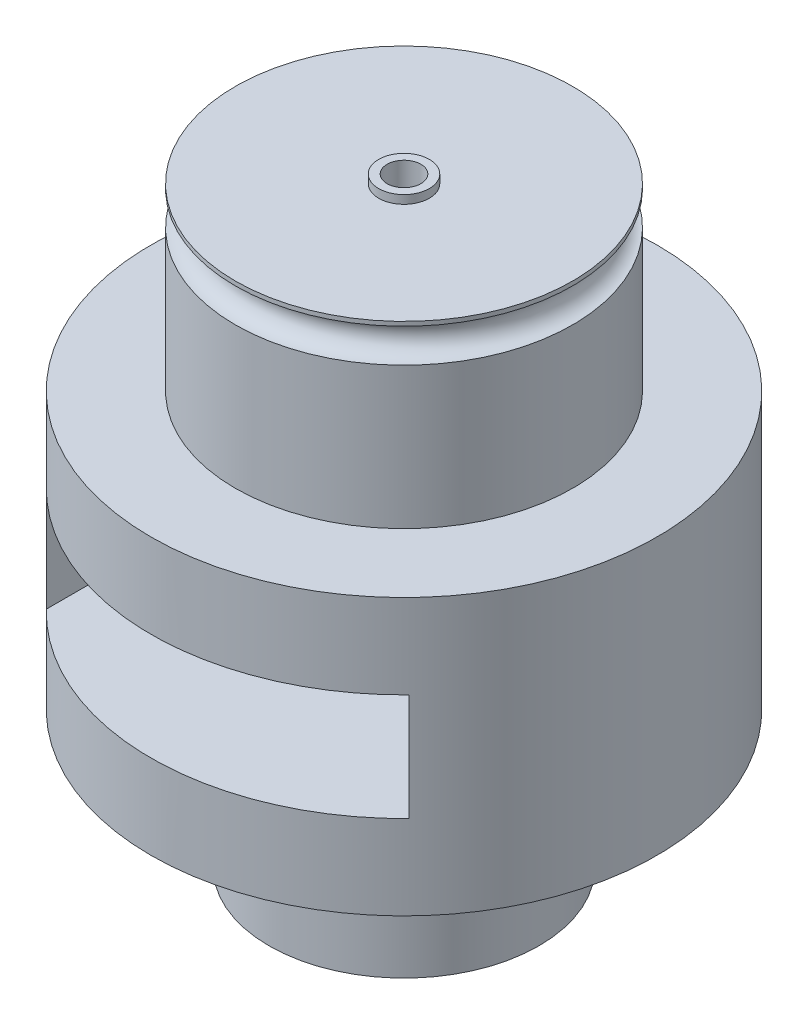
ISO-10303-21;
HEADER;
FILE_DESCRIPTION(('STEP AP214'),'2;1');
FILE_NAME('part.step','',(''),(''),'','','');
FILE_SCHEMA(('AUTOMOTIVE_DESIGN { 1 0 10303 214 1 1 1 1 }'));
ENDSEC;
DATA;
#1=APPLICATION_CONTEXT('core data for automotive mechanical design processes');
#2=APPLICATION_PROTOCOL_DEFINITION('international standard','automotive_design',2000,#1);
#3=PRODUCT_CONTEXT('',#1,'mechanical');
#4=PRODUCT('Part','Part','',(#3));
#5=PRODUCT_RELATED_PRODUCT_CATEGORY('part','',(#4));
#6=PRODUCT_DEFINITION_FORMATION('','',#4);
#7=PRODUCT_DEFINITION_CONTEXT('part definition',#1,'design');
#8=PRODUCT_DEFINITION('design','',#6,#7);
#9=PRODUCT_DEFINITION_SHAPE('','',#8);
#10=(LENGTH_UNIT() NAMED_UNIT(*) SI_UNIT(.MILLI.,.METRE.));
#11=(NAMED_UNIT(*) PLANE_ANGLE_UNIT() SI_UNIT($,.RADIAN.));
#12=(NAMED_UNIT(*) SI_UNIT($,.STERADIAN.) SOLID_ANGLE_UNIT());
#13=UNCERTAINTY_MEASURE_WITH_UNIT(LENGTH_MEASURE(1.E-05),#10,'distance_accuracy_value','');
#14=(GEOMETRIC_REPRESENTATION_CONTEXT(3) GLOBAL_UNCERTAINTY_ASSIGNED_CONTEXT((#13)) GLOBAL_UNIT_ASSIGNED_CONTEXT((#10,
#11,#12)) REPRESENTATION_CONTEXT('',''));
#15=CARTESIAN_POINT('',(0.,0.,0.));
#16=DIRECTION('',(0.,0.,1.));
#17=DIRECTION('',(1.,0.,0.));
#18=AXIS2_PLACEMENT_3D('',#15,#16,#17);
#19=CARTESIAN_POINT('',(0.,32.6375,0.));
#20=DIRECTION('',(0.,-1.,0.));
#21=DIRECTION('',(0.,0.,-1.));
#22=AXIS2_PLACEMENT_3D('',#19,#20,#21);
#23=CYLINDRICAL_SURFACE('',#22,15.);
#24=CARTESIAN_POINT('',(0.,8.14375,0.));
#25=DIRECTION('',(0.,-1.,0.));
#26=DIRECTION('',(0.,0.,-1.));
#27=AXIS2_PLACEMENT_3D('',#24,#25,#26);
#28=CIRCLE('',#27,15.);
#29=CARTESIAN_POINT('',(0.,8.14375,-15.));
#30=VERTEX_POINT('',#29);
#31=EDGE_CURVE('E176',#30,#30,#28,.F.);
#32=ORIENTED_EDGE('',*,*,#31,.T.);
#33=EDGE_LOOP('',(#32));
#34=FACE_BOUND('',#33,.T.);
#35=DIRECTION('',(0.,-1.,0.));
#36=VECTOR('',#35,1.);
#37=CARTESIAN_POINT('',(10.75,32.6375,-10.4612379764538));
#38=LINE('',#37,#36);
#39=CARTESIAN_POINT('',(10.75,13.14375,-10.4612379764538));
#40=VERTEX_POINT('',#39);
#41=CARTESIAN_POINT('',(10.75,19.49375,-10.4612379764538));
#42=VERTEX_POINT('',#41);
#43=EDGE_CURVE('E136',#40,#42,#38,.F.);
#44=ORIENTED_EDGE('',*,*,#43,.T.);
#45=CARTESIAN_POINT('',(0.,19.49375,0.));
#46=DIRECTION('',(0.,1.,0.));
#47=DIRECTION('',(0.,0.,1.));
#48=AXIS2_PLACEMENT_3D('',#45,#46,#47);
#49=CIRCLE('',#48,15.);
#50=CARTESIAN_POINT('',(-10.75,19.49375,-10.4612379764538));
#51=VERTEX_POINT('',#50);
#52=EDGE_CURVE('E111',#42,#51,#49,.T.);
#53=ORIENTED_EDGE('',*,*,#52,.T.);
#54=DIRECTION('',(0.,-1.,0.));
#55=VECTOR('',#54,1.);
#56=CARTESIAN_POINT('',(-10.75,32.6375,-10.4612379764538));
#57=LINE('',#56,#55);
#58=CARTESIAN_POINT('',(-10.75,13.14375,-10.4612379764538));
#59=VERTEX_POINT('',#58);
#60=EDGE_CURVE('E121',#51,#59,#57,.T.);
#61=ORIENTED_EDGE('',*,*,#60,.T.);
#62=CARTESIAN_POINT('',(0.,13.14375,0.));
#63=DIRECTION('',(0.,-1.,0.));
#64=DIRECTION('',(0.,0.,-1.));
#65=AXIS2_PLACEMENT_3D('',#62,#63,#64);
#66=CIRCLE('',#65,15.);
#67=EDGE_CURVE('E129',#59,#40,#66,.T.);
#68=ORIENTED_EDGE('',*,*,#67,.T.);
#69=EDGE_LOOP('',(#44,#53,#61,#68));
#70=FACE_BOUND('',#69,.T.);
#71=CARTESIAN_POINT('',(-10.75,19.49375,10.4612379764538));
#72=VERTEX_POINT('',#71);
#73=CARTESIAN_POINT('',(10.75,19.49375,10.4612379764538));
#74=VERTEX_POINT('',#73);
#75=EDGE_CURVE('E100',#72,#74,#49,.T.);
#76=ORIENTED_EDGE('',*,*,#75,.T.);
#77=DIRECTION('',(0.,-1.,0.));
#78=VECTOR('',#77,1.);
#79=CARTESIAN_POINT('',(10.75,32.6375,10.4612379764538));
#80=LINE('',#79,#78);
#81=CARTESIAN_POINT('',(10.75,13.14375,10.4612379764538));
#82=VERTEX_POINT('',#81);
#83=EDGE_CURVE('E126',#74,#82,#80,.T.);
#84=ORIENTED_EDGE('',*,*,#83,.T.);
#85=CARTESIAN_POINT('',(-10.75,13.14375,10.4612379764538));
#86=VERTEX_POINT('',#85);
#87=EDGE_CURVE('E125',#82,#86,#66,.T.);
#88=ORIENTED_EDGE('',*,*,#87,.T.);
#89=DIRECTION('',(0.,-1.,0.));
#90=VECTOR('',#89,1.);
#91=CARTESIAN_POINT('',(-10.75,32.6375,10.4612379764538));
#92=LINE('',#91,#90);
#93=EDGE_CURVE('E118',#86,#72,#92,.F.);
#94=ORIENTED_EDGE('',*,*,#93,.T.);
#95=EDGE_LOOP('',(#76,#84,#88,#94));
#96=FACE_BOUND('',#95,.T.);
#97=CARTESIAN_POINT('',(0.,24.49375,0.));
#98=DIRECTION('',(0.,1.,0.));
#99=DIRECTION('',(0.,0.,1.));
#100=AXIS2_PLACEMENT_3D('',#97,#98,#99);
#101=CIRCLE('',#100,15.);
#102=CARTESIAN_POINT('',(0.,24.49375,15.));
#103=VERTEX_POINT('',#102);
#104=EDGE_CURVE('E227',#103,#103,#101,.F.);
#105=ORIENTED_EDGE('',*,*,#104,.T.);
#106=EDGE_LOOP('',(#105));
#107=FACE_BOUND('',#106,.T.);
#108=ADVANCED_FACE('F57',(#34,#70,#96,#107),#23,.T.);
#109=CARTESIAN_POINT('',(0.,0.,0.));
#110=DIRECTION('',(0.,1.,0.));
#111=DIRECTION('',(0.,0.,1.));
#112=AXIS2_PLACEMENT_3D('',#109,#110,#111);
#113=PLANE('',#112);
#114=CARTESIAN_POINT('',(0.,0.,0.));
#115=DIRECTION('',(0.,1.,0.));
#116=DIRECTION('',(0.,0.,1.));
#117=AXIS2_PLACEMENT_3D('',#114,#115,#116);
#118=CIRCLE('',#117,1.5);
#119=CARTESIAN_POINT('',(0.,0.,1.5));
#120=VERTEX_POINT('',#119);
#121=EDGE_CURVE('E139',#120,#120,#118,.F.);
#122=ORIENTED_EDGE('',*,*,#121,.F.);
#123=EDGE_LOOP('',(#122));
#124=FACE_BOUND('',#123,.T.);
#125=CARTESIAN_POINT('',(0.,0.,0.));
#126=DIRECTION('',(0.,1.,0.));
#127=DIRECTION('',(0.,0.,1.));
#128=AXIS2_PLACEMENT_3D('',#125,#126,#127);
#129=CIRCLE('',#128,8.00000000000001);
#130=CARTESIAN_POINT('',(0.,0.,8.00000000000001));
#131=VERTEX_POINT('',#130);
#132=EDGE_CURVE('E60',#131,#131,#129,.T.);
#133=ORIENTED_EDGE('',*,*,#132,.F.);
#134=EDGE_LOOP('',(#133));
#135=FACE_BOUND('',#134,.T.);
#136=ADVANCED_FACE('F165',(#124,#135),#113,.F.);
#137=CARTESIAN_POINT('',(0.,35.1375,0.));
#138=DIRECTION('',(0.,1.,0.));
#139=DIRECTION('',(0.,0.,1.));
#140=AXIS2_PLACEMENT_3D('',#137,#138,#139);
#141=PLANE('',#140);
#142=CARTESIAN_POINT('',(0.,35.1375,0.));
#143=DIRECTION('',(0.,1.,0.));
#144=DIRECTION('',(0.,0.,1.));
#145=AXIS2_PLACEMENT_3D('',#142,#143,#144);
#146=CIRCLE('',#145,10.);
#147=CARTESIAN_POINT('',(0.,35.1375,10.));
#148=VERTEX_POINT('',#147);
#149=EDGE_CURVE('E205',#148,#148,#146,.T.);
#150=ORIENTED_EDGE('',*,*,#149,.T.);
#151=EDGE_LOOP('',(#150));
#152=FACE_BOUND('',#151,.T.);
#153=CARTESIAN_POINT('',(0.,35.1375,0.));
#154=DIRECTION('',(0.,1.,0.));
#155=DIRECTION('',(0.,0.,1.));
#156=AXIS2_PLACEMENT_3D('',#153,#154,#155);
#157=CIRCLE('',#156,1.5);
#158=CARTESIAN_POINT('',(0.,35.1375,1.5));
#159=VERTEX_POINT('',#158);
#160=EDGE_CURVE('E212',#159,#159,#157,.T.);
#161=ORIENTED_EDGE('',*,*,#160,.F.);
#162=EDGE_LOOP('',(#161));
#163=FACE_BOUND('',#162,.T.);
#164=ADVANCED_FACE('F171',(#152,#163),#141,.T.);
#165=CARTESIAN_POINT('',(0.,35.1375,0.));
#166=DIRECTION('',(0.,-1.,0.));
#167=DIRECTION('',(0.,0.,-1.));
#168=AXIS2_PLACEMENT_3D('',#165,#166,#167);
#169=CYLINDRICAL_SURFACE('',#168,10.);
#170=CARTESIAN_POINT('',(0.,34.8875,0.));
#171=DIRECTION('',(0.,-1.,0.));
#172=DIRECTION('',(0.,0.,-1.));
#173=AXIS2_PLACEMENT_3D('',#170,#171,#172);
#174=CIRCLE('',#173,10.);
#175=CARTESIAN_POINT('',(0.,34.8875,10.));
#176=VERTEX_POINT('',#175);
#177=EDGE_CURVE('E13',#176,#176,#174,.F.);
#178=ORIENTED_EDGE('',*,*,#177,.T.);
#179=EDGE_LOOP('',(#178));
#180=FACE_BOUND('',#179,.T.);
#181=ORIENTED_EDGE('',*,*,#149,.F.);
#182=EDGE_LOOP('',(#181));
#183=FACE_BOUND('',#182,.T.);
#184=ADVANCED_FACE('F161',(#180,#183),#169,.T.);
#185=CARTESIAN_POINT('',(0.,32.6375,0.));
#186=DIRECTION('',(0.,-1.,0.));
#187=DIRECTION('',(0.,0.,-1.));
#188=AXIS2_PLACEMENT_3D('',#185,#186,#187);
#189=CYLINDRICAL_SURFACE('',#188,1.);
#190=CARTESIAN_POINT('',(0.,13.14375,0.));
#191=DIRECTION('',(0.,-1.,0.));
#192=DIRECTION('',(0.,0.,-1.));
#193=AXIS2_PLACEMENT_3D('',#190,#191,#192);
#194=CIRCLE('',#193,1.);
#195=CARTESIAN_POINT('',(0.,13.14375,-1.));
#196=VERTEX_POINT('',#195);
#197=EDGE_CURVE('E132',#196,#196,#194,.T.);
#198=ORIENTED_EDGE('',*,*,#197,.F.);
#199=EDGE_LOOP('',(#198));
#200=FACE_BOUND('',#199,.T.);
#201=CARTESIAN_POINT('',(0.,-0.5,0.));
#202=DIRECTION('',(0.,-1.,0.));
#203=DIRECTION('',(0.,0.,-1.));
#204=AXIS2_PLACEMENT_3D('',#201,#202,#203);
#205=CIRCLE('',#204,1.);
#206=CARTESIAN_POINT('',(0.,-0.5,-1.));
#207=VERTEX_POINT('',#206);
#208=EDGE_CURVE('E203',#207,#207,#205,.T.);
#209=ORIENTED_EDGE('',*,*,#208,.T.);
#210=EDGE_LOOP('',(#209));
#211=FACE_BOUND('',#210,.T.);
#212=ADVANCED_FACE('F196',(#200,#211),#189,.F.);
#213=CARTESIAN_POINT('',(0.,19.49375,0.));
#214=DIRECTION('',(0.,1.,0.));
#215=DIRECTION('',(0.,0.,1.));
#216=AXIS2_PLACEMENT_3D('',#213,#214,#215);
#217=CIRCLE('',#216,1.);
#218=CARTESIAN_POINT('',(0.,19.49375,1.));
#219=VERTEX_POINT('',#218);
#220=EDGE_CURVE('E112',#219,#219,#217,.T.);
#221=ORIENTED_EDGE('',*,*,#220,.F.);
#222=EDGE_LOOP('',(#221));
#223=FACE_BOUND('',#222,.T.);
#224=CARTESIAN_POINT('',(0.,35.6375,0.));
#225=DIRECTION('',(0.,1.,0.));
#226=DIRECTION('',(0.,0.,1.));
#227=AXIS2_PLACEMENT_3D('',#224,#225,#226);
#228=CIRCLE('',#227,1.);
#229=CARTESIAN_POINT('',(0.,35.6375,1.));
#230=VERTEX_POINT('',#229);
#231=EDGE_CURVE('E215',#230,#230,#228,.T.);
#232=ORIENTED_EDGE('',*,*,#231,.T.);
#233=EDGE_LOOP('',(#232));
#234=FACE_BOUND('',#233,.T.);
#235=ADVANCED_FACE('F199',(#223,#234),#189,.F.);
#236=CARTESIAN_POINT('',(10.75,13.14375,-15.));
#237=DIRECTION('',(1.,0.,0.));
#238=DIRECTION('',(0.,0.,-1.));
#239=AXIS2_PLACEMENT_3D('',#236,#237,#238);
#240=PLANE('',#239);
#241=DIRECTION('',(0.,0.,1.));
#242=VECTOR('',#241,1.);
#243=CARTESIAN_POINT('',(10.75,19.49375,-15.));
#244=LINE('',#243,#242);
#245=EDGE_CURVE('E106',#42,#74,#244,.T.);
#246=ORIENTED_EDGE('',*,*,#245,.F.);
#247=ORIENTED_EDGE('',*,*,#43,.F.);
#248=DIRECTION('',(0.,0.,1.));
#249=VECTOR('',#248,1.);
#250=CARTESIAN_POINT('',(10.75,13.14375,-15.));
#251=LINE('',#250,#249);
#252=EDGE_CURVE('E182',#40,#82,#251,.T.);
#253=ORIENTED_EDGE('',*,*,#252,.T.);
#254=ORIENTED_EDGE('',*,*,#83,.F.);
#255=EDGE_LOOP('',(#246,#247,#253,#254));
#256=FACE_BOUND('',#255,.T.);
#257=ADVANCED_FACE('F181',(#256),#240,.F.);
#258=CARTESIAN_POINT('',(-10.75,13.14375,-15.));
#259=DIRECTION('',(-1.,0.,0.));
#260=DIRECTION('',(0.,0.,1.));
#261=AXIS2_PLACEMENT_3D('',#258,#259,#260);
#262=PLANE('',#261);
#263=DIRECTION('',(0.,0.,1.));
#264=VECTOR('',#263,1.);
#265=CARTESIAN_POINT('',(-10.75,19.49375,-15.));
#266=LINE('',#265,#264);
#267=EDGE_CURVE('E103',#51,#72,#266,.T.);
#268=ORIENTED_EDGE('',*,*,#267,.T.);
#269=ORIENTED_EDGE('',*,*,#93,.F.);
#270=DIRECTION('',(0.,0.,1.));
#271=VECTOR('',#270,1.);
#272=CARTESIAN_POINT('',(-10.75,13.14375,-15.));
#273=LINE('',#272,#271);
#274=EDGE_CURVE('E122',#59,#86,#273,.T.);
#275=ORIENTED_EDGE('',*,*,#274,.F.);
#276=ORIENTED_EDGE('',*,*,#60,.F.);
#277=EDGE_LOOP('',(#268,#269,#275,#276));
#278=FACE_BOUND('',#277,.T.);
#279=ADVANCED_FACE('F116',(#278),#262,.F.);
#280=CARTESIAN_POINT('',(-10.75,13.14375,-15.));
#281=DIRECTION('',(0.,-1.,0.));
#282=DIRECTION('',(0.,0.,-1.));
#283=AXIS2_PLACEMENT_3D('',#280,#281,#282);
#284=PLANE('',#283);
#285=ORIENTED_EDGE('',*,*,#197,.T.);
#286=EDGE_LOOP('',(#285));
#287=FACE_BOUND('',#286,.T.);
#288=ORIENTED_EDGE('',*,*,#252,.F.);
#289=ORIENTED_EDGE('',*,*,#67,.F.);
#290=ORIENTED_EDGE('',*,*,#274,.T.);
#291=ORIENTED_EDGE('',*,*,#87,.F.);
#292=EDGE_LOOP('',(#288,#289,#290,#291));
#293=FACE_BOUND('',#292,.T.);
#294=ADVANCED_FACE('F184',(#287,#293),#284,.F.);
#295=CARTESIAN_POINT('',(-10.75,19.49375,-15.));
#296=DIRECTION('',(0.,1.,0.));
#297=DIRECTION('',(0.,0.,1.));
#298=AXIS2_PLACEMENT_3D('',#295,#296,#297);
#299=PLANE('',#298);
#300=ORIENTED_EDGE('',*,*,#220,.T.);
#301=EDGE_LOOP('',(#300));
#302=FACE_BOUND('',#301,.T.);
#303=ORIENTED_EDGE('',*,*,#245,.T.);
#304=ORIENTED_EDGE('',*,*,#75,.F.);
#305=ORIENTED_EDGE('',*,*,#267,.F.);
#306=ORIENTED_EDGE('',*,*,#52,.F.);
#307=EDGE_LOOP('',(#303,#304,#305,#306));
#308=FACE_BOUND('',#307,.T.);
#309=ADVANCED_FACE('F102',(#302,#308),#299,.F.);
#310=CARTESIAN_POINT('',(0.,-0.5,0.));
#311=DIRECTION('',(0.,-1.,0.));
#312=DIRECTION('',(0.,0.,-1.));
#313=AXIS2_PLACEMENT_3D('',#310,#311,#312);
#314=PLANE('',#313);
#315=CARTESIAN_POINT('',(0.,-0.5,0.));
#316=DIRECTION('',(0.,-1.,0.));
#317=DIRECTION('',(0.,0.,-1.));
#318=AXIS2_PLACEMENT_3D('',#315,#316,#317);
#319=CIRCLE('',#318,1.5);
#320=CARTESIAN_POINT('',(0.,-0.5,-1.5));
#321=VERTEX_POINT('',#320);
#322=EDGE_CURVE('E189',#321,#321,#319,.T.);
#323=ORIENTED_EDGE('',*,*,#322,.T.);
#324=EDGE_LOOP('',(#323));
#325=FACE_BOUND('',#324,.T.);
#326=ORIENTED_EDGE('',*,*,#208,.F.);
#327=EDGE_LOOP('',(#326));
#328=FACE_BOUND('',#327,.T.);
#329=ADVANCED_FACE('F259',(#325,#328),#314,.T.);
#330=CARTESIAN_POINT('',(0.,-0.5,0.));
#331=DIRECTION('',(0.,1.,0.));
#332=DIRECTION('',(0.,0.,1.));
#333=AXIS2_PLACEMENT_3D('',#330,#331,#332);
#334=CYLINDRICAL_SURFACE('',#333,1.5);
#335=ORIENTED_EDGE('',*,*,#322,.F.);
#336=EDGE_LOOP('',(#335));
#337=FACE_BOUND('',#336,.T.);
#338=ORIENTED_EDGE('',*,*,#121,.T.);
#339=EDGE_LOOP('',(#338));
#340=FACE_BOUND('',#339,.T.);
#341=ADVANCED_FACE('F159',(#337,#340),#334,.T.);
#342=CARTESIAN_POINT('',(0.,32.8875,0.));
#343=DIRECTION('',(0.,1.,0.));
#344=DIRECTION('',(0.,0.,1.));
#345=AXIS2_PLACEMENT_3D('',#342,#343,#344);
#346=CIRCLE('',#345,10.);
#347=CARTESIAN_POINT('',(0.,32.8875,10.));
#348=VERTEX_POINT('',#347);
#349=EDGE_CURVE('E65',#348,#348,#346,.F.);
#350=ORIENTED_EDGE('',*,*,#349,.T.);
#351=EDGE_LOOP('',(#350));
#352=FACE_BOUND('',#351,.T.);
#353=CARTESIAN_POINT('',(0.,24.49375,0.));
#354=DIRECTION('',(0.,1.,0.));
#355=DIRECTION('',(0.,0.,1.));
#356=AXIS2_PLACEMENT_3D('',#353,#354,#355);
#357=CIRCLE('',#356,10.);
#358=CARTESIAN_POINT('',(0.,24.49375,10.));
#359=VERTEX_POINT('',#358);
#360=EDGE_CURVE('E224',#359,#359,#357,.F.);
#361=ORIENTED_EDGE('',*,*,#360,.F.);
#362=EDGE_LOOP('',(#361));
#363=FACE_BOUND('',#362,.T.);
#364=ADVANCED_FACE('F144',(#352,#363),#169,.T.);
#365=CARTESIAN_POINT('',(0.,33.8875,0.));
#366=DIRECTION('',(0.,1.,0.));
#367=DIRECTION('',(0.,0.,1.));
#368=AXIS2_PLACEMENT_3D('',#365,#366,#367);
#369=TOROIDAL_SURFACE('',#368,10.,1.);
#370=CARTESIAN_POINT('',(0.,33.8875,10.));
#371=DIRECTION('',(1.,0.,0.));
#372=DIRECTION('',(0.,1.,0.));
#373=AXIS2_PLACEMENT_3D('',#370,#371,#372);
#374=CIRCLE('',#373,1.);
#375=EDGE_CURVE('E72',#348,#176,#374,.T.);
#376=ORIENTED_EDGE('',*,*,#375,.F.);
#377=ORIENTED_EDGE('',*,*,#349,.F.);
#378=ORIENTED_EDGE('',*,*,#375,.T.);
#379=ORIENTED_EDGE('',*,*,#177,.F.);
#380=EDGE_LOOP('',(#376,#377,#378,#379));
#381=FACE_BOUND('',#380,.T.);
#382=ADVANCED_FACE('F146',(#381),#369,.F.);
#383=CARTESIAN_POINT('',(0.,35.6375,0.));
#384=DIRECTION('',(0.,1.,0.));
#385=DIRECTION('',(0.,0.,1.));
#386=AXIS2_PLACEMENT_3D('',#383,#384,#385);
#387=PLANE('',#386);
#388=CARTESIAN_POINT('',(0.,35.6375,0.));
#389=DIRECTION('',(0.,1.,0.));
#390=DIRECTION('',(0.,0.,1.));
#391=AXIS2_PLACEMENT_3D('',#388,#389,#390);
#392=CIRCLE('',#391,1.5);
#393=CARTESIAN_POINT('',(0.,35.6375,1.5));
#394=VERTEX_POINT('',#393);
#395=EDGE_CURVE('E211',#394,#394,#392,.T.);
#396=ORIENTED_EDGE('',*,*,#395,.T.);
#397=EDGE_LOOP('',(#396));
#398=FACE_BOUND('',#397,.T.);
#399=ORIENTED_EDGE('',*,*,#231,.F.);
#400=EDGE_LOOP('',(#399));
#401=FACE_BOUND('',#400,.T.);
#402=ADVANCED_FACE('F148',(#398,#401),#387,.T.);
#403=CARTESIAN_POINT('',(0.,35.6375,0.));
#404=DIRECTION('',(0.,-1.,0.));
#405=DIRECTION('',(0.,0.,-1.));
#406=AXIS2_PLACEMENT_3D('',#403,#404,#405);
#407=CYLINDRICAL_SURFACE('',#406,1.5);
#408=ORIENTED_EDGE('',*,*,#395,.F.);
#409=EDGE_LOOP('',(#408));
#410=FACE_BOUND('',#409,.T.);
#411=ORIENTED_EDGE('',*,*,#160,.T.);
#412=EDGE_LOOP('',(#411));
#413=FACE_BOUND('',#412,.T.);
#414=ADVANCED_FACE('F155',(#410,#413),#407,.T.);
#415=CARTESIAN_POINT('',(0.,55.5701568711929,0.));
#416=DIRECTION('',(0.,-1.,0.));
#417=DIRECTION('',(0.,0.,-1.));
#418=AXIS2_PLACEMENT_3D('',#415,#416,#417);
#419=CYLINDRICAL_SURFACE('',#418,8.00000000000001);
#420=CARTESIAN_POINT('',(0.,8.14375,0.));
#421=DIRECTION('',(0.,-1.,0.));
#422=DIRECTION('',(0.,0.,-1.));
#423=AXIS2_PLACEMENT_3D('',#420,#421,#422);
#424=CIRCLE('',#423,8.00000000000001);
#425=CARTESIAN_POINT('',(0.,8.14375,-8.00000000000001));
#426=VERTEX_POINT('',#425);
#427=EDGE_CURVE('E220',#426,#426,#424,.F.);
#428=ORIENTED_EDGE('',*,*,#427,.F.);
#429=EDGE_LOOP('',(#428));
#430=FACE_BOUND('',#429,.T.);
#431=ORIENTED_EDGE('',*,*,#132,.T.);
#432=EDGE_LOOP('',(#431));
#433=FACE_BOUND('',#432,.T.);
#434=ADVANCED_FACE('F239',(#430,#433),#419,.T.);
#435=CARTESIAN_POINT('',(-10.75,8.14375,-15.));
#436=DIRECTION('',(0.,-1.,0.));
#437=DIRECTION('',(0.,0.,-1.));
#438=AXIS2_PLACEMENT_3D('',#435,#436,#437);
#439=PLANE('',#438);
#440=ORIENTED_EDGE('',*,*,#31,.F.);
#441=EDGE_LOOP('',(#440));
#442=FACE_BOUND('',#441,.T.);
#443=ORIENTED_EDGE('',*,*,#427,.T.);
#444=EDGE_LOOP('',(#443));
#445=FACE_BOUND('',#444,.T.);
#446=ADVANCED_FACE('F234',(#442,#445),#439,.T.);
#447=CARTESIAN_POINT('',(-10.75,24.49375,-15.));
#448=DIRECTION('',(0.,1.,0.));
#449=DIRECTION('',(0.,0.,1.));
#450=AXIS2_PLACEMENT_3D('',#447,#448,#449);
#451=PLANE('',#450);
#452=ORIENTED_EDGE('',*,*,#104,.F.);
#453=EDGE_LOOP('',(#452));
#454=FACE_BOUND('',#453,.T.);
#455=ORIENTED_EDGE('',*,*,#360,.T.);
#456=EDGE_LOOP('',(#455));
#457=FACE_BOUND('',#456,.T.);
#458=ADVANCED_FACE('F231',(#454,#457),#451,.T.);
#459=CLOSED_SHELL('',(#108,#136,#164,#184,#212,#235,#257,#279,#294,#309,#329,#341,#364,#382,
#402,#414,#434,#446,#458));
#460=MANIFOLD_SOLID_BREP('B2',#459);
#461=ADVANCED_BREP_SHAPE_REPRESENTATION('',(#18,#460),#14);
#462=SHAPE_DEFINITION_REPRESENTATION(#9,#461);
ENDSEC;
END-ISO-10303-21;
